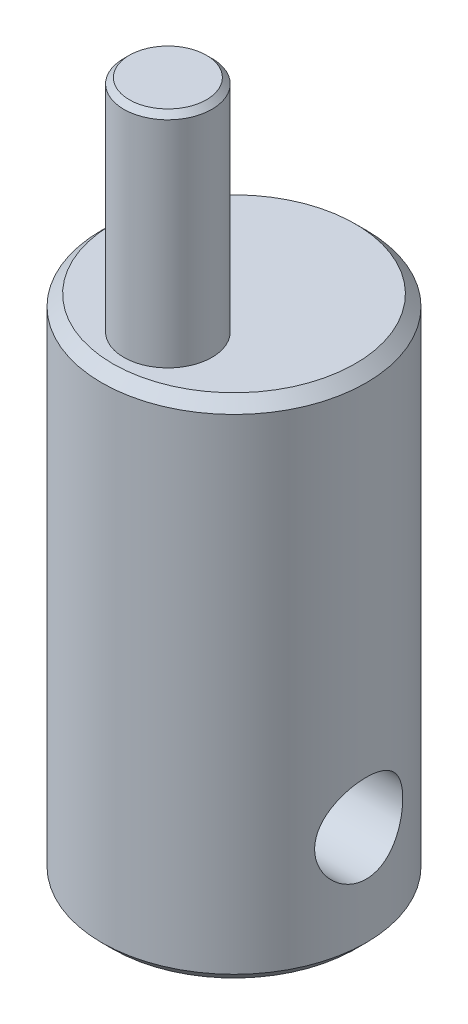
ISO-10303-21;
HEADER;
FILE_DESCRIPTION(('STEP AP214'),'2;1');
FILE_NAME('part.step','',(''),(''),'','','');
FILE_SCHEMA(('AUTOMOTIVE_DESIGN { 1 0 10303 214 1 1 1 1 }'));
ENDSEC;
DATA;
#1=APPLICATION_CONTEXT('core data for automotive mechanical design processes');
#2=APPLICATION_PROTOCOL_DEFINITION('international standard','automotive_design',2000,#1);
#3=PRODUCT_CONTEXT('',#1,'mechanical');
#4=PRODUCT('Part','Part','',(#3));
#5=PRODUCT_RELATED_PRODUCT_CATEGORY('part','',(#4));
#6=PRODUCT_DEFINITION_FORMATION('','',#4);
#7=PRODUCT_DEFINITION_CONTEXT('part definition',#1,'design');
#8=PRODUCT_DEFINITION('design','',#6,#7);
#9=PRODUCT_DEFINITION_SHAPE('','',#8);
#10=(LENGTH_UNIT() NAMED_UNIT(*) SI_UNIT(.MILLI.,.METRE.));
#11=(NAMED_UNIT(*) PLANE_ANGLE_UNIT() SI_UNIT($,.RADIAN.));
#12=(NAMED_UNIT(*) SI_UNIT($,.STERADIAN.) SOLID_ANGLE_UNIT());
#13=UNCERTAINTY_MEASURE_WITH_UNIT(LENGTH_MEASURE(1.E-05),#10,'distance_accuracy_value','');
#14=(GEOMETRIC_REPRESENTATION_CONTEXT(3) GLOBAL_UNCERTAINTY_ASSIGNED_CONTEXT((#13)) GLOBAL_UNIT_ASSIGNED_CONTEXT((#10,
#11,#12)) REPRESENTATION_CONTEXT('',''));
#15=CARTESIAN_POINT('',(0.,0.,0.));
#16=DIRECTION('',(0.,0.,1.));
#17=DIRECTION('',(1.,0.,0.));
#18=AXIS2_PLACEMENT_3D('',#15,#16,#17);
#19=CARTESIAN_POINT('',(0.,11.5,0.));
#20=DIRECTION('',(0.,-1.,0.));
#21=DIRECTION('',(0.,0.,-1.));
#22=AXIS2_PLACEMENT_3D('',#19,#20,#21);
#23=CYLINDRICAL_SURFACE('',#22,3.);
#24=CARTESIAN_POINT('',(0.,0.250000000000004,0.));
#25=DIRECTION('',(0.,1.,0.));
#26=DIRECTION('',(0.,0.,1.));
#27=AXIS2_PLACEMENT_3D('',#24,#25,#26);
#28=CIRCLE('',#27,3.);
#29=CARTESIAN_POINT('',(0.,0.250000000000004,3.));
#30=VERTEX_POINT('',#29);
#31=EDGE_CURVE('E62',#30,#30,#28,.T.);
#32=ORIENTED_EDGE('',*,*,#31,.T.);
#33=EDGE_LOOP('',(#32));
#34=FACE_BOUND('',#33,.T.);
#35=CARTESIAN_POINT('',(0.,11.25,0.));
#36=DIRECTION('',(0.,1.,0.));
#37=DIRECTION('',(0.,0.,1.));
#38=AXIS2_PLACEMENT_3D('',#35,#36,#37);
#39=CIRCLE('',#38,3.);
#40=CARTESIAN_POINT('',(0.,11.25,3.));
#41=VERTEX_POINT('',#40);
#42=EDGE_CURVE('E68',#41,#41,#39,.F.);
#43=ORIENTED_EDGE('',*,*,#42,.T.);
#44=EDGE_LOOP('',(#43));
#45=FACE_BOUND('',#44,.T.);
#46=CARTESIAN_POINT('',(-3.,1.5,0.));
#47=CARTESIAN_POINT('',(-3.00000015300943,1.49999974626836,-0.0545633628867233));
#48=CARTESIAN_POINT('',(-2.99849769507545,1.50448026612722,-0.10912519453855));
#49=CARTESIAN_POINT('',(-2.99265210203281,1.52222910881722,-0.216641760872972));
#50=CARTESIAN_POINT('',(-2.98830867202153,1.53549834394892,-0.269596328118818));
#51=CARTESIAN_POINT('',(-2.97725307906443,1.57031924338405,-0.372332789501776));
#52=CARTESIAN_POINT('',(-2.97054487730853,1.59185706245927,-0.422119825886034));
#53=CARTESIAN_POINT('',(-2.95544445717342,1.64254117283835,-0.517374936805325));
#54=CARTESIAN_POINT('',(-2.94705190667778,1.6716889650026,-0.562842156958706));
#55=CARTESIAN_POINT('',(-2.92914094443005,1.73782580485875,-0.649741675022266));
#56=CARTESIAN_POINT('',(-2.91959556463785,1.77503123426049,-0.691003700298309));
#57=CARTESIAN_POINT('',(-2.90060314783122,1.85576715470657,-0.766832692702084));
#58=CARTESIAN_POINT('',(-2.89115613290549,1.89929903492851,-0.801398185489462));
#59=CARTESIAN_POINT('',(-2.87313332477274,1.99298511519646,-0.863824942227859));
#60=CARTESIAN_POINT('',(-2.86459039275688,2.04329373973212,-0.891464858221032));
#61=CARTESIAN_POINT('',(-2.84975305418601,2.14817609445855,-0.937818873877721));
#62=CARTESIAN_POINT('',(-2.84345796160746,2.20274851716274,-0.956535697386765));
#63=CARTESIAN_POINT('',(-2.83411303269377,2.31267322149671,-0.983873461509163));
#64=CARTESIAN_POINT('',(-2.83096095769611,2.36793720848906,-0.992813448271769));
#65=CARTESIAN_POINT('',(-2.82795656629508,2.47926375415588,-1.00134112333448));
#66=CARTESIAN_POINT('',(-2.8281032302273,2.53532606070919,-1.00093170160472));
#67=CARTESIAN_POINT('',(-2.8315901500818,2.64393663044402,-0.991019903703419));
#68=CARTESIAN_POINT('',(-2.83478415867533,2.69652840291902,-0.981933913166995));
#69=CARTESIAN_POINT('',(-2.84376657724551,2.79939341960683,-0.955606162849417));
#70=CARTESIAN_POINT('',(-2.84955529784108,2.84966638543507,-0.938363426591871));
#71=CARTESIAN_POINT('',(-2.86317911131249,2.94741274959148,-0.895939058060211));
#72=CARTESIAN_POINT('',(-2.87104565793117,2.99482802546953,-0.870634048707263));
#73=CARTESIAN_POINT('',(-2.88792558575726,3.08487090827973,-0.812889106303139));
#74=CARTESIAN_POINT('',(-2.89693929790464,3.12749712693338,-0.780447112364006));
#75=CARTESIAN_POINT('',(-2.91567329167741,3.20909159816077,-0.707349332682238));
#76=CARTESIAN_POINT('',(-2.92540589354843,3.24775269450907,-0.666353150076312));
#77=CARTESIAN_POINT('',(-2.94406938387037,3.3177312666634,-0.578339569970064));
#78=CARTESIAN_POINT('',(-2.95300019538067,3.3490480381645,-0.531321595660815));
#79=CARTESIAN_POINT('',(-2.96917107937794,3.40369630023507,-0.431947613046268));
#80=CARTESIAN_POINT('',(-2.97639350008039,3.42694549134073,-0.379543276416337));
#81=CARTESIAN_POINT('',(-2.98820567144435,3.46420317395571,-0.271269083364508));
#82=CARTESIAN_POINT('',(-2.99279633654879,3.47821487542344,-0.215400438154954));
#83=CARTESIAN_POINT('',(-2.99867627071441,3.49605566602236,-0.104383829529304));
#84=CARTESIAN_POINT('',(-3.00010001833731,3.50029980917275,-0.0493095998648453));
#85=CARTESIAN_POINT('',(-2.99988902694825,3.49966732640153,0.0607750699602363));
#86=CARTESIAN_POINT('',(-2.99825480419352,3.49479224002013,0.115785519319647));
#87=CARTESIAN_POINT('',(-2.99220024717114,3.47638809226403,0.222519866304259));
#88=CARTESIAN_POINT('',(-2.98786198711228,3.46311379395048,0.274292806834856));
#89=CARTESIAN_POINT('',(-2.97691846830034,3.4286065555333,0.374855958579561));
#90=CARTESIAN_POINT('',(-2.97031292046541,3.40737260053233,0.423645788508559));
#91=CARTESIAN_POINT('',(-2.95528931287427,3.3569295681591,0.518288296393321));
#92=CARTESIAN_POINT('',(-2.94682814756305,3.3275254067164,0.56402995921733));
#93=CARTESIAN_POINT('',(-2.92905253915743,3.26180584998695,0.650064830135404));
#94=CARTESIAN_POINT('',(-2.91973783591888,3.22548834396984,0.690356367794894));
#95=CARTESIAN_POINT('',(-2.90076847982472,3.14502124899174,0.766252507807014));
#96=CARTESIAN_POINT('',(-2.89111761095155,3.10059077306675,0.801560969248492));
#97=CARTESIAN_POINT('',(-2.87299973286981,3.0062284321955,0.864257522320854));
#98=CARTESIAN_POINT('',(-2.8645327335312,2.9562965213898,0.891645547920843));
#99=CARTESIAN_POINT('',(-2.84982391820308,2.85232698469341,0.93759693042336));
#100=CARTESIAN_POINT('',(-2.84357760900632,2.79829792075722,0.956178132197766));
#101=CARTESIAN_POINT('',(-2.83410832399133,2.68762134987585,0.983894666792163));
#102=CARTESIAN_POINT('',(-2.83088398622698,2.63097503456694,0.993034254961243));
#103=CARTESIAN_POINT('',(-2.82797858875071,2.51980290398679,1.00127628247038));
#104=CARTESIAN_POINT('',(-2.82812400344299,2.46531765974826,1.00087025731093));
#105=CARTESIAN_POINT('',(-2.8315126992356,2.35723492510026,0.991242293454878));
#106=CARTESIAN_POINT('',(-2.83475579595884,2.30363738204709,0.982020879458887));
#107=CARTESIAN_POINT('',(-2.84384524278943,2.19986433698733,0.95537181312698));
#108=CARTESIAN_POINT('',(-2.84964098015514,2.14964317499277,0.93810334601488));
#109=CARTESIAN_POINT('',(-2.86316398825434,2.05277259306447,0.895979365760381));
#110=CARTESIAN_POINT('',(-2.87089168765297,2.00612396881274,0.871122168553979));
#111=CARTESIAN_POINT('',(-2.8878282922406,1.91551633007631,0.813260692583249));
#112=CARTESIAN_POINT('',(-2.89708711641604,1.8717634981014,0.779948242764532));
#113=CARTESIAN_POINT('',(-2.91583356283786,1.79031018661601,0.706642883135697));
#114=CARTESIAN_POINT('',(-2.92532124912518,1.75261142431198,0.666648084451495));
#115=CARTESIAN_POINT('',(-2.94390030525393,1.68285558771076,0.579241556920674));
#116=CARTESIAN_POINT('',(-2.95296181801216,1.65107565224898,0.531601513499725));
#117=CARTESIAN_POINT('',(-2.96925991172652,1.59600957114937,0.431357357406628));
#118=CARTESIAN_POINT('',(-2.9764969590794,1.57272125407796,0.378754518132349));
#119=CARTESIAN_POINT('',(-2.98805515068532,1.53627836751132,0.272493647200975));
#120=CARTESIAN_POINT('',(-2.9924921242252,1.52271753373662,0.218987757676408));
#121=CARTESIAN_POINT('',(-2.99846407064225,1.50457971932287,0.110320416010247));
#122=CARTESIAN_POINT('',(-2.99999984531906,1.50000025650346,0.0551594255687466));
#123=CARTESIAN_POINT('',(-3.,1.5,0.));
#124=B_SPLINE_CURVE_WITH_KNOTS('',3,(#46,#47,#48,#49,#50,#51,#52,#53,#54,#55,#56,#57,#58,#59,
#60,#61,#62,#63,#64,#65,#66,#67,#68,#69,#70,#71,#72,#73,#74,#75,#76,#77,#78,#79,#80,#81,#82,#83,
#84,#85,#86,#87,#88,#89,#90,#91,#92,#93,#94,#95,#96,#97,#98,#99,#100,#101,#102,#103,#104,#105,
#106,#107,#108,#109,#110,#111,#112,#113,#114,#115,#116,#117,#118,#119,#120,#121,#122,#123),
.UNSPECIFIED.,.T.,.F.,(4,2,2,2,2,2,2,2,2,2,2,2,2,2,2,2,2,2,2,2,2,2,2,2,2,2,2,2,2,2,2,2,2,2,2,2,
2,2,4),(0.,0.163487106026011,0.326991185267521,0.490222672870274,0.6534863777991,
0.821846842827559,0.990244332875302,1.1634838482347,1.33667044692833,1.5040192574184,
1.67131633987485,1.8309682655128,1.99063930855482,2.15288171155131,2.31517102558207,
2.48593305811367,2.65671145966618,2.82918405650358,3.00159668877208,3.1665358317517,
3.33144713164177,3.49158157978213,3.65173645284104,3.81610399843736,3.98052180821891,
4.15241022880752,4.32430008234997,4.49584013824416,4.66730284700846,4.82995666056619,
4.99260079341185,5.15215587070228,5.31174638165788,5.47830066681615,5.64490211113589,
5.8179966082491,5.99104681142266,6.15636558363624,6.3216386602795),.UNSPECIFIED.);
#125=CARTESIAN_POINT('',(-3.,1.5,0.));
#126=VERTEX_POINT('',#125);
#127=EDGE_CURVE('E76',#126,#126,#124,.T.);
#128=ORIENTED_EDGE('',*,*,#127,.T.);
#129=EDGE_LOOP('',(#128));
#130=FACE_BOUND('',#129,.T.);
#131=CARTESIAN_POINT('',(2.82842712474619,2.5,-1.));
#132=CARTESIAN_POINT('',(2.82842694532735,2.44553182518932,-1.0000002579478));
#133=CARTESIAN_POINT('',(2.83001769372806,2.39106520022848,-0.99553478369814));
#134=CARTESIAN_POINT('',(2.8361757417458,2.28374557904938,-0.977851131702564));
#135=CARTESIAN_POINT('',(2.8407435316722,2.23089285013606,-0.964631512170673));
#136=CARTESIAN_POINT('',(2.85228203663888,2.12837310698719,-0.929955485680263));
#137=CARTESIAN_POINT('',(2.8592480396464,2.07870007055312,-0.908515221402));
#138=CARTESIAN_POINT('',(2.87479122017008,1.98363995145621,-0.858061628442627));
#139=CARTESIAN_POINT('',(2.88336875305432,1.9382538174475,-0.829046628860523));
#140=CARTESIAN_POINT('',(2.90154489405589,1.85128003766051,-0.763051146442527));
#141=CARTESIAN_POINT('',(2.91116894844139,1.80988457132796,-0.725824341377826));
#142=CARTESIAN_POINT('',(2.93013864801508,1.73379319877568,-0.64498766721449));
#143=CARTESIAN_POINT('',(2.93948424829099,1.69909836841772,-0.601376775052402));
#144=CARTESIAN_POINT('',(2.95713866921658,1.63652110267032,-0.507604507964985));
#145=CARTESIAN_POINT('',(2.96541407701568,1.60884002938202,-0.457301911224519));
#146=CARTESIAN_POINT('',(2.9796958677102,1.56240841487251,-0.352431222987482));
#147=CARTESIAN_POINT('',(2.98570286203012,1.5436554668231,-0.297864285687215));
#148=CARTESIAN_POINT('',(2.99459075431897,1.5162641453676,-0.188028817433493));
#149=CARTESIAN_POINT('',(2.99757314777558,1.50729655374299,-0.132850754852968));
#150=CARTESIAN_POINT('',(3.00043608218249,1.49868370663934,-0.0216978748240915));
#151=CARTESIAN_POINT('',(3.00031742262891,1.49903604834758,0.0342767335438925));
#152=CARTESIAN_POINT('',(2.99706039618736,1.50884425456603,0.143103515193817));
#153=CARTESIAN_POINT('',(2.99404064755135,1.51794252847451,0.195992048591667));
#154=CARTESIAN_POINT('',(2.98546967339714,1.54439298098045,0.29944343882216));
#155=CARTESIAN_POINT('',(2.97991827631115,1.56174571897976,0.350006137779175));
#156=CARTESIAN_POINT('',(2.96675670293292,1.60442131730613,0.448152474842013));
#157=CARTESIAN_POINT('',(2.9591204252427,1.62984593854678,0.495688220968998));
#158=CARTESIAN_POINT('',(2.94258393038665,1.68785970544839,0.585924325527169));
#159=CARTESIAN_POINT('',(2.93368336200518,1.72045084332664,0.628623334384769));
#160=CARTESIAN_POINT('',(2.9150619185089,1.79367439346074,0.710100866551906));
#161=CARTESIAN_POINT('',(2.90532215172667,1.83461315784544,0.748600157067556));
#162=CARTESIAN_POINT('',(2.88647335245111,1.92244872572266,0.81827725959589));
#163=CARTESIAN_POINT('',(2.8773644173145,1.96934644571324,0.849453943273005));
#164=CARTESIAN_POINT('',(2.86070525135531,2.06865362561541,0.903987455042732));
#165=CARTESIAN_POINT('',(2.85317909338821,2.12113213136781,0.927226463651049));
#166=CARTESIAN_POINT('',(2.84081650878299,2.22957139426626,0.964443193299506));
#167=CARTESIAN_POINT('',(2.83597895501223,2.28553068122182,0.978424795755529));
#168=CARTESIAN_POINT('',(2.8297963630207,2.39663835540062,0.996161282090474));
#169=CARTESIAN_POINT('',(2.82830360315139,2.45170942474572,1.00034909550575));
#170=CARTESIAN_POINT('',(2.828566720628,2.56177614911704,0.999605438911604));
#171=CARTESIAN_POINT('',(2.83032200792768,2.61677181602476,0.99467562522726));
#172=CARTESIAN_POINT('',(2.83673618089379,2.72315696571116,0.97622565155183));
#173=CARTESIAN_POINT('',(2.84129325440593,2.77460543015064,0.963006393980555));
#174=CARTESIAN_POINT('',(2.8526855367127,2.87454360623938,0.928713862560596));
#175=CARTESIAN_POINT('',(2.85952114934907,2.92303279159083,0.907639196363457));
#176=CARTESIAN_POINT('',(2.87496877595718,3.01738042084694,0.857474340738901));
#177=CARTESIAN_POINT('',(2.8836302566561,3.06310664264179,0.828151118358487));
#178=CARTESIAN_POINT('',(2.90165768730984,3.14914605238373,0.762585630557568));
#179=CARTESIAN_POINT('',(2.91102384443799,3.18945763866122,0.726341325498785));
#180=CARTESIAN_POINT('',(2.92995038637844,3.26552798409063,0.645891705900323));
#181=CARTESIAN_POINT('',(2.93949843577895,3.30097439001885,0.601387270546652));
#182=CARTESIAN_POINT('',(2.9572685161311,3.36391614234804,0.506827291400258));
#183=CARTESIAN_POINT('',(2.96549059417695,3.39141177116242,0.456771944864553));
#184=CARTESIAN_POINT('',(2.97964405810603,3.43742010486171,0.352779862432296));
#185=CARTESIAN_POINT('',(2.98559030004531,3.45599127714806,0.298871123321197));
#186=CARTESIAN_POINT('',(2.99458610837774,3.4837277420601,0.188458465846017));
#187=CARTESIAN_POINT('',(2.99763672034018,3.4928964298805,0.13195549195389));
#188=CARTESIAN_POINT('',(3.00041863236257,3.50126207760564,0.0208153358600411));
#189=CARTESIAN_POINT('',(3.00029920089441,3.50090745393238,-0.0337847239200187));
#190=CARTESIAN_POINT('',(2.99712196519396,3.49134269185359,-0.142111145000173));
#191=CARTESIAN_POINT('',(2.99406439933567,3.48213327184724,-0.195837576819055));
#192=CARTESIAN_POINT('',(2.98540914954421,3.45541776542403,-0.30004211943206));
#193=CARTESIAN_POINT('',(2.9798525836118,3.43804578464705,-0.350558270912795));
#194=CARTESIAN_POINT('',(2.96677160704464,3.39562246890286,-0.447978350939789));
#195=CARTESIAN_POINT('',(2.95924684047901,3.37056974480306,-0.49488162414241));
#196=CARTESIAN_POINT('',(2.94265868828001,3.31243048789792,-0.585634016308809));
#197=CARTESIAN_POINT('',(2.93354872492381,3.27908131461808,-0.629306251557696));
#198=CARTESIAN_POINT('',(2.91492988791425,3.20574260884409,-0.710581026272338));
#199=CARTESIAN_POINT('',(2.90542088771397,3.16575095773832,-0.748181621624259));
#200=CARTESIAN_POINT('',(2.88663279827365,3.07839064441196,-0.817741808833464));
#201=CARTESIAN_POINT('',(2.87737727995345,3.03079448901923,-0.849422965999217));
#202=CARTESIAN_POINT('',(2.86060193316303,2.93066557310135,-0.904314343299799));
#203=CARTESIAN_POINT('',(2.8530816513617,2.87813410698576,-0.927526776814559));
#204=CARTESIAN_POINT('',(2.84101334230535,2.77203817597617,-0.963843828206626));
#205=CARTESIAN_POINT('',(2.83634632944799,2.71862773643428,-0.977357909163268));
#206=CARTESIAN_POINT('',(2.8300538361394,2.61014394948453,-0.995434320161694));
#207=CARTESIAN_POINT('',(2.82842730615135,2.55507118256425,-0.999999739196501));
#208=CARTESIAN_POINT('',(2.82842712474619,2.5,-1.));
#209=B_SPLINE_CURVE_WITH_KNOTS('',3,(#131,#132,#133,#134,#135,#136,#137,#138,#139,#140,#141,
#142,#143,#144,#145,#146,#147,#148,#149,#150,#151,#152,#153,#154,#155,#156,#157,#158,#159,#160,
#161,#162,#163,#164,#165,#166,#167,#168,#169,#170,#171,#172,#173,#174,#175,#176,#177,#178,#179,
#180,#181,#182,#183,#184,#185,#186,#187,#188,#189,#190,#191,#192,#193,#194,#195,#196,#197,#198,
#199,#200,#201,#202,#203,#204,#205,#206,#207,#208),.UNSPECIFIED.,.T.,.F.,(4,2,2,2,2,2,2,2,2,2,2,
2,2,2,2,2,2,2,2,2,2,2,2,2,2,2,2,2,2,2,2,2,2,2,2,2,2,2,4),(0.,0.163200584775417,0.32642805496888,
0.489336627454543,0.652281166139158,0.821013374229397,0.989772651673595,1.16293506139029,
1.33605076382161,1.50314318760306,1.67019253297699,1.83069004820941,1.99119844184608,
2.15381654855707,2.31647991869394,2.48680174359289,2.65714979607478,2.82992639837376,
3.00263051349688,3.16754291357512,3.33242535830307,3.49164395761849,3.65089079140019,
3.81518857728788,3.979534856552,4.15178808164165,4.32403518750605,4.49513791183924,
4.66617882997229,4.82918084670708,4.99216964002854,5.15256956033503,5.31299850756315,
5.47935519513706,5.64576504425704,5.81868902729217,5.99156778259939,6.15663212153686,
6.32163947179229),.UNSPECIFIED.);
#210=CARTESIAN_POINT('',(2.82842712474619,2.5,-1.));
#211=VERTEX_POINT('',#210);
#212=EDGE_CURVE('E85',#211,#211,#209,.T.);
#213=ORIENTED_EDGE('',*,*,#212,.T.);
#214=EDGE_LOOP('',(#213));
#215=FACE_BOUND('',#214,.T.);
#216=ADVANCED_FACE('F43',(#34,#45,#130,#215),#23,.T.);
#217=CARTESIAN_POINT('',(0.,11.5,0.));
#218=DIRECTION('',(0.,1.,0.));
#219=DIRECTION('',(0.,0.,1.));
#220=AXIS2_PLACEMENT_3D('',#217,#218,#219);
#221=PLANE('',#220);
#222=CARTESIAN_POINT('',(0.,11.5,0.));
#223=DIRECTION('',(0.,1.,0.));
#224=DIRECTION('',(0.,0.,1.));
#225=AXIS2_PLACEMENT_3D('',#222,#223,#224);
#226=CIRCLE('',#225,2.75);
#227=CARTESIAN_POINT('',(0.,11.5,2.75));
#228=VERTEX_POINT('',#227);
#229=EDGE_CURVE('E72',#228,#228,#226,.T.);
#230=ORIENTED_EDGE('',*,*,#229,.T.);
#231=EDGE_LOOP('',(#230));
#232=FACE_BOUND('',#231,.T.);
#233=CARTESIAN_POINT('',(0.,11.5,1.5));
#234=DIRECTION('',(0.,1.,0.));
#235=DIRECTION('',(0.,0.,1.));
#236=AXIS2_PLACEMENT_3D('',#233,#234,#235);
#237=CIRCLE('',#236,1.);
#238=CARTESIAN_POINT('',(0.,11.5,2.5));
#239=VERTEX_POINT('',#238);
#240=EDGE_CURVE('E127',#239,#239,#237,.T.);
#241=ORIENTED_EDGE('',*,*,#240,.F.);
#242=EDGE_LOOP('',(#241));
#243=FACE_BOUND('',#242,.T.);
#244=ADVANCED_FACE('F107',(#232,#243),#221,.T.);
#245=CARTESIAN_POINT('',(0.,0.,0.));
#246=DIRECTION('',(0.,1.,0.));
#247=DIRECTION('',(0.,0.,1.));
#248=AXIS2_PLACEMENT_3D('',#245,#246,#247);
#249=PLANE('',#248);
#250=CARTESIAN_POINT('',(0.,0.,0.));
#251=DIRECTION('',(0.,1.,0.));
#252=DIRECTION('',(0.,0.,1.));
#253=AXIS2_PLACEMENT_3D('',#250,#251,#252);
#254=CIRCLE('',#253,2.75);
#255=CARTESIAN_POINT('',(0.,0.,2.75));
#256=VERTEX_POINT('',#255);
#257=EDGE_CURVE('E57',#256,#256,#254,.F.);
#258=ORIENTED_EDGE('',*,*,#257,.T.);
#259=EDGE_LOOP('',(#258));
#260=FACE_BOUND('',#259,.T.);
#261=ADVANCED_FACE('F106',(#260),#249,.F.);
#262=CARTESIAN_POINT('',(0.,16.5,1.5));
#263=DIRECTION('',(0.,-1.,0.));
#264=DIRECTION('',(0.,0.,-1.));
#265=AXIS2_PLACEMENT_3D('',#262,#263,#264);
#266=CYLINDRICAL_SURFACE('',#265,1.);
#267=CARTESIAN_POINT('',(0.,16.375,1.5));
#268=DIRECTION('',(0.,1.,0.));
#269=DIRECTION('',(0.,0.,1.));
#270=AXIS2_PLACEMENT_3D('',#267,#268,#269);
#271=CIRCLE('',#270,1.);
#272=CARTESIAN_POINT('',(0.,16.375,2.5));
#273=VERTEX_POINT('',#272);
#274=EDGE_CURVE('E10',#273,#273,#271,.F.);
#275=ORIENTED_EDGE('',*,*,#274,.T.);
#276=EDGE_LOOP('',(#275));
#277=FACE_BOUND('',#276,.T.);
#278=ORIENTED_EDGE('',*,*,#240,.T.);
#279=EDGE_LOOP('',(#278));
#280=FACE_BOUND('',#279,.T.);
#281=ADVANCED_FACE('F103',(#277,#280),#266,.T.);
#282=CARTESIAN_POINT('',(0.,16.5,1.5));
#283=DIRECTION('',(0.,1.,0.));
#284=DIRECTION('',(0.,0.,1.));
#285=AXIS2_PLACEMENT_3D('',#282,#283,#284);
#286=PLANE('',#285);
#287=CARTESIAN_POINT('',(0.,16.5,1.5));
#288=DIRECTION('',(0.,1.,0.));
#289=DIRECTION('',(0.,0.,1.));
#290=AXIS2_PLACEMENT_3D('',#287,#288,#289);
#291=CIRCLE('',#290,0.875000000000003);
#292=CARTESIAN_POINT('',(0.,16.5,2.375));
#293=VERTEX_POINT('',#292);
#294=EDGE_CURVE('E52',#293,#293,#291,.T.);
#295=ORIENTED_EDGE('',*,*,#294,.T.);
#296=EDGE_LOOP('',(#295));
#297=FACE_BOUND('',#296,.T.);
#298=ADVANCED_FACE('F98',(#297),#286,.T.);
#299=CARTESIAN_POINT('',(-3.,2.5,0.));
#300=DIRECTION('',(1.,0.,0.));
#301=DIRECTION('',(0.,0.,-1.));
#302=AXIS2_PLACEMENT_3D('',#299,#300,#301);
#303=CYLINDRICAL_SURFACE('',#302,1.);
#304=ORIENTED_EDGE('',*,*,#212,.F.);
#305=EDGE_LOOP('',(#304));
#306=FACE_BOUND('',#305,.T.);
#307=ORIENTED_EDGE('',*,*,#127,.F.);
#308=EDGE_LOOP('',(#307));
#309=FACE_BOUND('',#308,.T.);
#310=ADVANCED_FACE('F93',(#306,#309),#303,.F.);
#311=CARTESIAN_POINT('',(0.,11.5,0.));
#312=DIRECTION('',(0.,-1.,0.));
#313=DIRECTION('',(0.,0.,-1.));
#314=AXIS2_PLACEMENT_3D('',#311,#312,#313);
#315=CONICAL_SURFACE('',#314,2.75,0.785398163397447);
#316=ORIENTED_EDGE('',*,*,#42,.F.);
#317=EDGE_LOOP('',(#316));
#318=FACE_BOUND('',#317,.T.);
#319=ORIENTED_EDGE('',*,*,#229,.F.);
#320=EDGE_LOOP('',(#319));
#321=FACE_BOUND('',#320,.T.);
#322=ADVANCED_FACE('F97',(#318,#321),#315,.T.);
#323=CARTESIAN_POINT('',(0.,0.250000000000004,0.));
#324=DIRECTION('',(0.,1.,0.));
#325=DIRECTION('',(0.,0.,1.));
#326=AXIS2_PLACEMENT_3D('',#323,#324,#325);
#327=CONICAL_SURFACE('',#326,3.,0.785398163397444);
#328=ORIENTED_EDGE('',*,*,#257,.F.);
#329=EDGE_LOOP('',(#328));
#330=FACE_BOUND('',#329,.T.);
#331=ORIENTED_EDGE('',*,*,#31,.F.);
#332=EDGE_LOOP('',(#331));
#333=FACE_BOUND('',#332,.T.);
#334=ADVANCED_FACE('F137',(#330,#333),#327,.T.);
#335=CARTESIAN_POINT('',(0.,16.5,1.5));
#336=DIRECTION('',(0.,-1.,0.));
#337=DIRECTION('',(0.,0.,-1.));
#338=AXIS2_PLACEMENT_3D('',#335,#336,#337);
#339=CONICAL_SURFACE('',#338,0.875000000000003,0.785398163397438);
#340=ORIENTED_EDGE('',*,*,#274,.F.);
#341=EDGE_LOOP('',(#340));
#342=FACE_BOUND('',#341,.T.);
#343=ORIENTED_EDGE('',*,*,#294,.F.);
#344=EDGE_LOOP('',(#343));
#345=FACE_BOUND('',#344,.T.);
#346=ADVANCED_FACE('F46',(#342,#345),#339,.T.);
#347=CLOSED_SHELL('',(#216,#244,#261,#281,#298,#310,#322,#334,#346));
#348=MANIFOLD_SOLID_BREP('B2',#347);
#349=ADVANCED_BREP_SHAPE_REPRESENTATION('',(#18,#348),#14);
#350=SHAPE_DEFINITION_REPRESENTATION(#9,#349);
ENDSEC;
END-ISO-10303-21;
